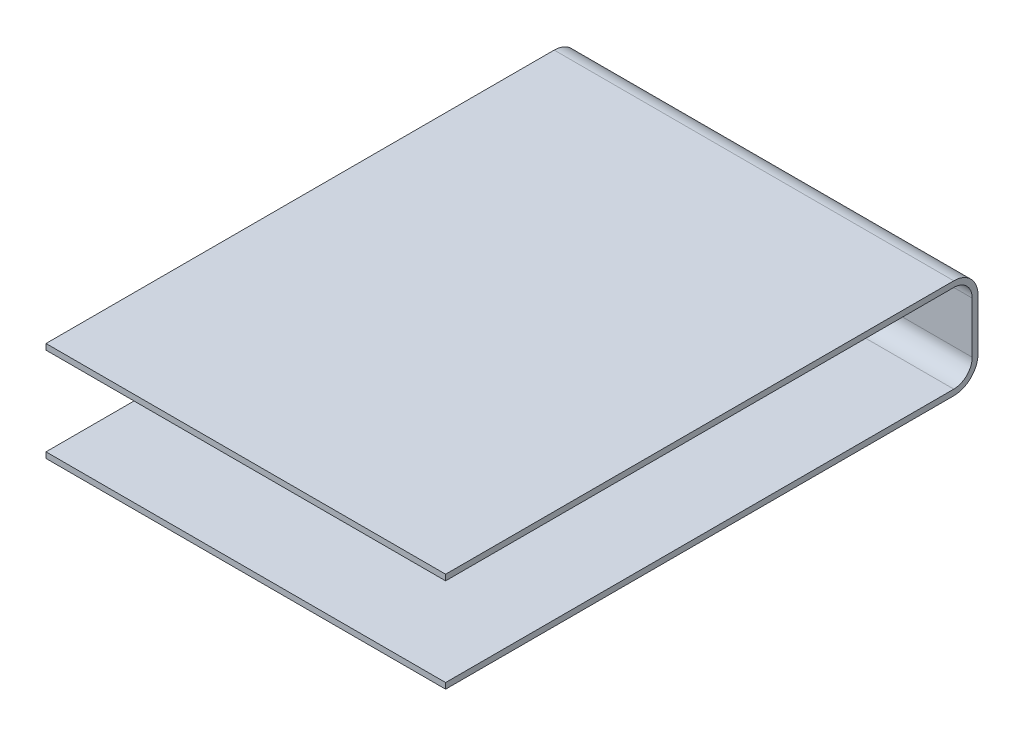
ISO-10303-21;
HEADER;
FILE_DESCRIPTION(('STEP AP214'),'2;1');
FILE_NAME('part.step','',(''),(''),'','','');
FILE_SCHEMA(('AUTOMOTIVE_DESIGN { 1 0 10303 214 1 1 1 1 }'));
ENDSEC;
DATA;
#1=APPLICATION_CONTEXT('core data for automotive mechanical design processes');
#2=APPLICATION_PROTOCOL_DEFINITION('international standard','automotive_design',2000,#1);
#3=PRODUCT_CONTEXT('',#1,'mechanical');
#4=PRODUCT('Part','Part','',(#3));
#5=PRODUCT_RELATED_PRODUCT_CATEGORY('part','',(#4));
#6=PRODUCT_DEFINITION_FORMATION('','',#4);
#7=PRODUCT_DEFINITION_CONTEXT('part definition',#1,'design');
#8=PRODUCT_DEFINITION('design','',#6,#7);
#9=PRODUCT_DEFINITION_SHAPE('','',#8);
#10=(LENGTH_UNIT() NAMED_UNIT(*) SI_UNIT(.MILLI.,.METRE.));
#11=(NAMED_UNIT(*) PLANE_ANGLE_UNIT() SI_UNIT($,.RADIAN.));
#12=(NAMED_UNIT(*) SI_UNIT($,.STERADIAN.) SOLID_ANGLE_UNIT());
#13=UNCERTAINTY_MEASURE_WITH_UNIT(LENGTH_MEASURE(1.E-05),#10,'distance_accuracy_value','');
#14=(GEOMETRIC_REPRESENTATION_CONTEXT(3) GLOBAL_UNCERTAINTY_ASSIGNED_CONTEXT((#13)) GLOBAL_UNIT_ASSIGNED_CONTEXT((#10,
#11,#12)) REPRESENTATION_CONTEXT('',''));
#15=CARTESIAN_POINT('',(0.,0.,0.));
#16=DIRECTION('',(0.,0.,1.));
#17=DIRECTION('',(1.,0.,0.));
#18=AXIS2_PLACEMENT_3D('',#15,#16,#17);
#19=CARTESIAN_POINT('',(-7590.,350.,0.));
#20=DIRECTION('',(1.,0.,0.));
#21=DIRECTION('',(0.,0.,-1.));
#22=AXIS2_PLACEMENT_3D('',#19,#20,#21);
#23=CYLINDRICAL_SURFACE('',#22,350.);
#24=CARTESIAN_POINT('',(0.,350.,0.));
#25=DIRECTION('',(-1.,0.,0.));
#26=DIRECTION('',(0.,0.,-1.));
#27=AXIS2_PLACEMENT_3D('',#24,#25,#26);
#28=CIRCLE('',#27,350.);
#29=CARTESIAN_POINT('',(0.,350.,-350.));
#30=VERTEX_POINT('',#29);
#31=CARTESIAN_POINT('',(0.,0.,0.));
#32=VERTEX_POINT('',#31);
#33=EDGE_CURVE('E157',#30,#32,#28,.T.);
#34=ORIENTED_EDGE('',*,*,#33,.F.);
#35=DIRECTION('',(1.,0.,0.));
#36=VECTOR('',#35,1.);
#37=CARTESIAN_POINT('',(-7590.,350.,-350.));
#38=LINE('',#37,#36);
#39=CARTESIAN_POINT('',(-7590.,350.,-350.));
#40=VERTEX_POINT('',#39);
#41=EDGE_CURVE('E11',#40,#30,#38,.T.);
#42=ORIENTED_EDGE('',*,*,#41,.F.);
#43=CARTESIAN_POINT('',(-7590.,350.,0.));
#44=DIRECTION('',(-1.,0.,0.));
#45=DIRECTION('',(0.,0.,-1.));
#46=AXIS2_PLACEMENT_3D('',#43,#44,#45);
#47=CIRCLE('',#46,350.);
#48=CARTESIAN_POINT('',(-7590.,0.,0.));
#49=VERTEX_POINT('',#48);
#50=EDGE_CURVE('E189',#40,#49,#47,.T.);
#51=ORIENTED_EDGE('',*,*,#50,.T.);
#52=DIRECTION('',(1.,0.,0.));
#53=VECTOR('',#52,1.);
#54=CARTESIAN_POINT('',(-7590.,0.,0.));
#55=LINE('',#54,#53);
#56=EDGE_CURVE('E39',#49,#32,#55,.T.);
#57=ORIENTED_EDGE('',*,*,#56,.T.);
#58=EDGE_LOOP('',(#34,#42,#51,#57));
#59=FACE_BOUND('',#58,.T.);
#60=ADVANCED_FACE('F36',(#59),#23,.F.);
#61=CARTESIAN_POINT('',(-7590.,1322.,-350.));
#62=DIRECTION('',(0.,0.,1.));
#63=DIRECTION('',(0.,-1.,0.));
#64=AXIS2_PLACEMENT_3D('',#61,#62,#63);
#65=PLANE('',#64);
#66=DIRECTION('',(0.,-1.,0.));
#67=VECTOR('',#66,1.);
#68=CARTESIAN_POINT('',(0.,1322.,-350.));
#69=LINE('',#68,#67);
#70=CARTESIAN_POINT('',(0.,1322.,-350.));
#71=VERTEX_POINT('',#70);
#72=EDGE_CURVE('E187',#71,#30,#69,.T.);
#73=ORIENTED_EDGE('',*,*,#72,.F.);
#74=DIRECTION('',(1.,0.,0.));
#75=VECTOR('',#74,1.);
#76=CARTESIAN_POINT('',(-7590.,1322.,-350.));
#77=LINE('',#76,#75);
#78=CARTESIAN_POINT('',(-7590.,1322.,-350.));
#79=VERTEX_POINT('',#78);
#80=EDGE_CURVE('E45',#79,#71,#77,.T.);
#81=ORIENTED_EDGE('',*,*,#80,.F.);
#82=DIRECTION('',(0.,-1.,0.));
#83=VECTOR('',#82,1.);
#84=CARTESIAN_POINT('',(-7590.,1322.,-350.));
#85=LINE('',#84,#83);
#86=EDGE_CURVE('E147',#79,#40,#85,.T.);
#87=ORIENTED_EDGE('',*,*,#86,.T.);
#88=ORIENTED_EDGE('',*,*,#41,.T.);
#89=EDGE_LOOP('',(#73,#81,#87,#88));
#90=FACE_BOUND('',#89,.T.);
#91=ADVANCED_FACE('F209',(#90),#65,.T.);
#92=CARTESIAN_POINT('',(-7590.,1322.,1.66533453693773E-13));
#93=DIRECTION('',(1.,0.,0.));
#94=DIRECTION('',(0.,0.,-1.));
#95=AXIS2_PLACEMENT_3D('',#92,#93,#94);
#96=CYLINDRICAL_SURFACE('',#95,350.);
#97=CARTESIAN_POINT('',(0.,1322.,1.66533453693773E-13));
#98=DIRECTION('',(-1.,0.,0.));
#99=DIRECTION('',(0.,0.,1.));
#100=AXIS2_PLACEMENT_3D('',#97,#98,#99);
#101=CIRCLE('',#100,350.);
#102=CARTESIAN_POINT('',(0.,1672.,2.09396091663931E-13));
#103=VERTEX_POINT('',#102);
#104=EDGE_CURVE('E134',#103,#71,#101,.T.);
#105=ORIENTED_EDGE('',*,*,#104,.F.);
#106=DIRECTION('',(1.,0.,0.));
#107=VECTOR('',#106,1.);
#108=CARTESIAN_POINT('',(-7590.,1672.,2.09396091663931E-13));
#109=LINE('',#108,#107);
#110=CARTESIAN_POINT('',(-7590.,1672.,2.09396091663931E-13));
#111=VERTEX_POINT('',#110);
#112=EDGE_CURVE('E129',#111,#103,#109,.T.);
#113=ORIENTED_EDGE('',*,*,#112,.F.);
#114=CARTESIAN_POINT('',(-7590.,1322.,1.66533453693773E-13));
#115=DIRECTION('',(-1.,0.,0.));
#116=DIRECTION('',(0.,0.,1.));
#117=AXIS2_PLACEMENT_3D('',#114,#115,#116);
#118=CIRCLE('',#117,350.);
#119=EDGE_CURVE('E132',#111,#79,#118,.T.);
#120=ORIENTED_EDGE('',*,*,#119,.T.);
#121=ORIENTED_EDGE('',*,*,#80,.T.);
#122=EDGE_LOOP('',(#105,#113,#120,#121));
#123=FACE_BOUND('',#122,.T.);
#124=ADVANCED_FACE('F131',(#123),#96,.F.);
#125=CARTESIAN_POINT('',(-7590.,1672.,2.09396091663931E-13));
#126=DIRECTION('',(0.,-1.,0.));
#127=DIRECTION('',(0.,0.,-1.));
#128=AXIS2_PLACEMENT_3D('',#125,#126,#127);
#129=PLANE('',#128);
#130=DIRECTION('',(0.,0.,-1.));
#131=VECTOR('',#130,1.);
#132=CARTESIAN_POINT('',(0.,1672.,2.09396091663931E-13));
#133=LINE('',#132,#131);
#134=CARTESIAN_POINT('',(0.,1672.,9652.));
#135=VERTEX_POINT('',#134);
#136=EDGE_CURVE('E184',#135,#103,#133,.T.);
#137=ORIENTED_EDGE('',*,*,#136,.F.);
#138=DIRECTION('',(1.,0.,0.));
#139=VECTOR('',#138,1.);
#140=CARTESIAN_POINT('',(-7590.,1672.,9652.));
#141=LINE('',#140,#139);
#142=CARTESIAN_POINT('',(-7590.,1672.,9652.));
#143=VERTEX_POINT('',#142);
#144=EDGE_CURVE('E139',#143,#135,#141,.T.);
#145=ORIENTED_EDGE('',*,*,#144,.F.);
#146=DIRECTION('',(0.,0.,-1.));
#147=VECTOR('',#146,1.);
#148=CARTESIAN_POINT('',(-7590.,1672.,2.09396091663931E-13));
#149=LINE('',#148,#147);
#150=EDGE_CURVE('E145',#143,#111,#149,.T.);
#151=ORIENTED_EDGE('',*,*,#150,.T.);
#152=ORIENTED_EDGE('',*,*,#112,.T.);
#153=EDGE_LOOP('',(#137,#145,#151,#152));
#154=FACE_BOUND('',#153,.T.);
#155=ADVANCED_FACE('F149',(#154),#129,.T.);
#156=CARTESIAN_POINT('',(-7590.,1672.,9652.));
#157=DIRECTION('',(0.,0.,1.));
#158=DIRECTION('',(1.,0.,0.));
#159=AXIS2_PLACEMENT_3D('',#156,#157,#158);
#160=PLANE('',#159);
#161=DIRECTION('',(0.,-1.,0.));
#162=VECTOR('',#161,1.);
#163=CARTESIAN_POINT('',(0.,1672.,9652.));
#164=LINE('',#163,#162);
#165=CARTESIAN_POINT('',(0.,1782.,9652.));
#166=VERTEX_POINT('',#165);
#167=EDGE_CURVE('E181',#166,#135,#164,.T.);
#168=ORIENTED_EDGE('',*,*,#167,.F.);
#169=DIRECTION('',(1.,0.,0.));
#170=VECTOR('',#169,1.);
#171=CARTESIAN_POINT('',(-7590.,1782.,9652.));
#172=LINE('',#171,#170);
#173=CARTESIAN_POINT('',(-7590.,1782.,9652.));
#174=VERTEX_POINT('',#173);
#175=EDGE_CURVE('E193',#174,#166,#172,.T.);
#176=ORIENTED_EDGE('',*,*,#175,.F.);
#177=DIRECTION('',(0.,-1.,0.));
#178=VECTOR('',#177,1.);
#179=CARTESIAN_POINT('',(-7590.,1672.,9652.));
#180=LINE('',#179,#178);
#181=EDGE_CURVE('E150',#174,#143,#180,.T.);
#182=ORIENTED_EDGE('',*,*,#181,.T.);
#183=ORIENTED_EDGE('',*,*,#144,.T.);
#184=EDGE_LOOP('',(#168,#176,#182,#183));
#185=FACE_BOUND('',#184,.T.);
#186=ADVANCED_FACE('F222',(#185),#160,.T.);
#187=CARTESIAN_POINT('',(-7590.,1782.,9652.));
#188=DIRECTION('',(0.,1.,0.));
#189=DIRECTION('',(0.,0.,1.));
#190=AXIS2_PLACEMENT_3D('',#187,#188,#189);
#191=PLANE('',#190);
#192=DIRECTION('',(0.,0.,1.));
#193=VECTOR('',#192,1.);
#194=CARTESIAN_POINT('',(0.,1782.,9652.));
#195=LINE('',#194,#193);
#196=CARTESIAN_POINT('',(0.,1782.,0.));
#197=VERTEX_POINT('',#196);
#198=EDGE_CURVE('E178',#197,#166,#195,.T.);
#199=ORIENTED_EDGE('',*,*,#198,.F.);
#200=DIRECTION('',(1.,0.,0.));
#201=VECTOR('',#200,1.);
#202=CARTESIAN_POINT('',(-7590.,1782.,0.));
#203=LINE('',#202,#201);
#204=CARTESIAN_POINT('',(-7590.,1782.,0.));
#205=VERTEX_POINT('',#204);
#206=EDGE_CURVE('E195',#205,#197,#203,.T.);
#207=ORIENTED_EDGE('',*,*,#206,.F.);
#208=DIRECTION('',(0.,0.,1.));
#209=VECTOR('',#208,1.);
#210=CARTESIAN_POINT('',(-7590.,1782.,9652.));
#211=LINE('',#210,#209);
#212=EDGE_CURVE('E152',#205,#174,#211,.T.);
#213=ORIENTED_EDGE('',*,*,#212,.T.);
#214=ORIENTED_EDGE('',*,*,#175,.T.);
#215=EDGE_LOOP('',(#199,#207,#213,#214));
#216=FACE_BOUND('',#215,.T.);
#217=ADVANCED_FACE('F225',(#216),#191,.T.);
#218=CARTESIAN_POINT('',(-7590.,1322.,0.));
#219=DIRECTION('',(1.,0.,0.));
#220=DIRECTION('',(0.,0.,-1.));
#221=AXIS2_PLACEMENT_3D('',#218,#219,#220);
#222=CYLINDRICAL_SURFACE('',#221,459.999999999999);
#223=CARTESIAN_POINT('',(0.,1322.,0.));
#224=DIRECTION('',(1.,0.,0.));
#225=DIRECTION('',(0.,0.,1.));
#226=AXIS2_PLACEMENT_3D('',#223,#224,#225);
#227=CIRCLE('',#226,459.999999999999);
#228=CARTESIAN_POINT('',(0.,1322.,-459.999999999999));
#229=VERTEX_POINT('',#228);
#230=EDGE_CURVE('E175',#229,#197,#227,.T.);
#231=ORIENTED_EDGE('',*,*,#230,.F.);
#232=DIRECTION('',(1.,0.,0.));
#233=VECTOR('',#232,1.);
#234=CARTESIAN_POINT('',(-7590.,1322.,-459.999999999999));
#235=LINE('',#234,#233);
#236=CARTESIAN_POINT('',(-7590.,1322.,-459.999999999999));
#237=VERTEX_POINT('',#236);
#238=EDGE_CURVE('E197',#237,#229,#235,.T.);
#239=ORIENTED_EDGE('',*,*,#238,.F.);
#240=CARTESIAN_POINT('',(-7590.,1322.,0.));
#241=DIRECTION('',(1.,0.,0.));
#242=DIRECTION('',(0.,0.,1.));
#243=AXIS2_PLACEMENT_3D('',#240,#241,#242);
#244=CIRCLE('',#243,459.999999999999);
#245=EDGE_CURVE('E351',#237,#205,#244,.T.);
#246=ORIENTED_EDGE('',*,*,#245,.T.);
#247=ORIENTED_EDGE('',*,*,#206,.T.);
#248=EDGE_LOOP('',(#231,#239,#246,#247));
#249=FACE_BOUND('',#248,.T.);
#250=ADVANCED_FACE('F229',(#249),#222,.T.);
#251=CARTESIAN_POINT('',(-7590.,1322.,-459.999999999999));
#252=DIRECTION('',(0.,0.,-1.));
#253=DIRECTION('',(0.,1.,0.));
#254=AXIS2_PLACEMENT_3D('',#251,#252,#253);
#255=PLANE('',#254);
#256=DIRECTION('',(0.,1.,0.));
#257=VECTOR('',#256,1.);
#258=CARTESIAN_POINT('',(0.,1322.,-459.999999999999));
#259=LINE('',#258,#257);
#260=CARTESIAN_POINT('',(0.,349.999999999998,-459.999999999999));
#261=VERTEX_POINT('',#260);
#262=EDGE_CURVE('E172',#261,#229,#259,.T.);
#263=ORIENTED_EDGE('',*,*,#262,.F.);
#264=DIRECTION('',(1.,0.,0.));
#265=VECTOR('',#264,1.);
#266=CARTESIAN_POINT('',(-7590.,349.999999999998,-459.999999999999));
#267=LINE('',#266,#265);
#268=CARTESIAN_POINT('',(-7590.,349.999999999998,-459.999999999999));
#269=VERTEX_POINT('',#268);
#270=EDGE_CURVE('E199',#269,#261,#267,.T.);
#271=ORIENTED_EDGE('',*,*,#270,.F.);
#272=DIRECTION('',(0.,1.,0.));
#273=VECTOR('',#272,1.);
#274=CARTESIAN_POINT('',(-7590.,1322.,-459.999999999999));
#275=LINE('',#274,#273);
#276=EDGE_CURVE('E355',#269,#237,#275,.T.);
#277=ORIENTED_EDGE('',*,*,#276,.T.);
#278=ORIENTED_EDGE('',*,*,#238,.T.);
#279=EDGE_LOOP('',(#263,#271,#277,#278));
#280=FACE_BOUND('',#279,.T.);
#281=ADVANCED_FACE('F233',(#280),#255,.T.);
#282=CARTESIAN_POINT('',(-7590.,349.999999999998,0.));
#283=DIRECTION('',(1.,0.,0.));
#284=DIRECTION('',(0.,0.,-1.));
#285=AXIS2_PLACEMENT_3D('',#282,#283,#284);
#286=CYLINDRICAL_SURFACE('',#285,459.999999999999);
#287=CARTESIAN_POINT('',(0.,349.999999999998,0.));
#288=DIRECTION('',(1.,0.,0.));
#289=DIRECTION('',(0.,0.,-1.));
#290=AXIS2_PLACEMENT_3D('',#287,#288,#289);
#291=CIRCLE('',#290,459.999999999999);
#292=CARTESIAN_POINT('',(0.,-110.000000000001,0.));
#293=VERTEX_POINT('',#292);
#294=EDGE_CURVE('E169',#293,#261,#291,.T.);
#295=ORIENTED_EDGE('',*,*,#294,.F.);
#296=DIRECTION('',(1.,0.,0.));
#297=VECTOR('',#296,1.);
#298=CARTESIAN_POINT('',(-7590.,-110.000000000001,0.));
#299=LINE('',#298,#297);
#300=CARTESIAN_POINT('',(-7590.,-110.000000000001,0.));
#301=VERTEX_POINT('',#300);
#302=EDGE_CURVE('E201',#301,#293,#299,.T.);
#303=ORIENTED_EDGE('',*,*,#302,.F.);
#304=CARTESIAN_POINT('',(-7590.,349.999999999998,0.));
#305=DIRECTION('',(1.,0.,0.));
#306=DIRECTION('',(0.,0.,-1.));
#307=AXIS2_PLACEMENT_3D('',#304,#305,#306);
#308=CIRCLE('',#307,459.999999999999);
#309=EDGE_CURVE('E344',#301,#269,#308,.T.);
#310=ORIENTED_EDGE('',*,*,#309,.T.);
#311=ORIENTED_EDGE('',*,*,#270,.T.);
#312=EDGE_LOOP('',(#295,#303,#310,#311));
#313=FACE_BOUND('',#312,.T.);
#314=ADVANCED_FACE('F237',(#313),#286,.T.);
#315=CARTESIAN_POINT('',(-7590.,-110.000000000001,9652.));
#316=DIRECTION('',(0.,-1.,0.));
#317=DIRECTION('',(0.,0.,-1.));
#318=AXIS2_PLACEMENT_3D('',#315,#316,#317);
#319=PLANE('',#318);
#320=DIRECTION('',(0.,0.,-1.));
#321=VECTOR('',#320,1.);
#322=CARTESIAN_POINT('',(0.,-110.000000000001,9652.));
#323=LINE('',#322,#321);
#324=CARTESIAN_POINT('',(0.,-110.000000000001,9652.));
#325=VERTEX_POINT('',#324);
#326=EDGE_CURVE('E166',#325,#293,#323,.T.);
#327=ORIENTED_EDGE('',*,*,#326,.F.);
#328=DIRECTION('',(1.,0.,0.));
#329=VECTOR('',#328,1.);
#330=CARTESIAN_POINT('',(-7590.,-110.000000000001,9652.));
#331=LINE('',#330,#329);
#332=CARTESIAN_POINT('',(-7590.,-110.000000000001,9652.));
#333=VERTEX_POINT('',#332);
#334=EDGE_CURVE('E203',#333,#325,#331,.T.);
#335=ORIENTED_EDGE('',*,*,#334,.F.);
#336=DIRECTION('',(0.,0.,-1.));
#337=VECTOR('',#336,1.);
#338=CARTESIAN_POINT('',(-7590.,-110.000000000001,9652.));
#339=LINE('',#338,#337);
#340=EDGE_CURVE('E340',#333,#301,#339,.T.);
#341=ORIENTED_EDGE('',*,*,#340,.T.);
#342=ORIENTED_EDGE('',*,*,#302,.T.);
#343=EDGE_LOOP('',(#327,#335,#341,#342));
#344=FACE_BOUND('',#343,.T.);
#345=ADVANCED_FACE('F241',(#344),#319,.T.);
#346=CARTESIAN_POINT('',(-7590.,-1.18202909053703E-12,9652.));
#347=DIRECTION('',(0.,0.,1.));
#348=DIRECTION('',(1.,0.,0.));
#349=AXIS2_PLACEMENT_3D('',#346,#347,#348);
#350=PLANE('',#349);
#351=DIRECTION('',(0.,-1.,0.));
#352=VECTOR('',#351,1.);
#353=CARTESIAN_POINT('',(0.,-1.18202909053703E-12,9652.));
#354=LINE('',#353,#352);
#355=CARTESIAN_POINT('',(0.,-1.18202909053703E-12,9652.));
#356=VERTEX_POINT('',#355);
#357=EDGE_CURVE('E163',#356,#325,#354,.T.);
#358=ORIENTED_EDGE('',*,*,#357,.F.);
#359=DIRECTION('',(1.,0.,0.));
#360=VECTOR('',#359,1.);
#361=CARTESIAN_POINT('',(-7590.,-1.18202909053703E-12,9652.));
#362=LINE('',#361,#360);
#363=CARTESIAN_POINT('',(-7590.,-1.18202909053703E-12,9652.));
#364=VERTEX_POINT('',#363);
#365=EDGE_CURVE('E204',#364,#356,#362,.T.);
#366=ORIENTED_EDGE('',*,*,#365,.F.);
#367=DIRECTION('',(0.,-1.,0.));
#368=VECTOR('',#367,1.);
#369=CARTESIAN_POINT('',(-7590.,-1.18202909053703E-12,9652.));
#370=LINE('',#369,#368);
#371=EDGE_CURVE('E361',#364,#333,#370,.T.);
#372=ORIENTED_EDGE('',*,*,#371,.T.);
#373=ORIENTED_EDGE('',*,*,#334,.T.);
#374=EDGE_LOOP('',(#358,#366,#372,#373));
#375=FACE_BOUND('',#374,.T.);
#376=ADVANCED_FACE('F245',(#375),#350,.T.);
#377=CARTESIAN_POINT('',(-7590.,0.,0.));
#378=DIRECTION('',(0.,1.,0.));
#379=DIRECTION('',(0.,0.,1.));
#380=AXIS2_PLACEMENT_3D('',#377,#378,#379);
#381=PLANE('',#380);
#382=DIRECTION('',(0.,0.,1.));
#383=VECTOR('',#382,1.);
#384=CARTESIAN_POINT('',(0.,0.,0.));
#385=LINE('',#384,#383);
#386=EDGE_CURVE('E160',#32,#356,#385,.T.);
#387=ORIENTED_EDGE('',*,*,#386,.F.);
#388=ORIENTED_EDGE('',*,*,#56,.F.);
#389=DIRECTION('',(0.,0.,1.));
#390=VECTOR('',#389,1.);
#391=CARTESIAN_POINT('',(-7590.,0.,0.));
#392=LINE('',#391,#390);
#393=EDGE_CURVE('E363',#49,#364,#392,.T.);
#394=ORIENTED_EDGE('',*,*,#393,.T.);
#395=ORIENTED_EDGE('',*,*,#365,.T.);
#396=EDGE_LOOP('',(#387,#388,#394,#395));
#397=FACE_BOUND('',#396,.T.);
#398=ADVANCED_FACE('F206',(#397),#381,.T.);
#399=CARTESIAN_POINT('',(-7590.,350.,0.));
#400=DIRECTION('',(1.,0.,0.));
#401=DIRECTION('',(0.,0.,-1.));
#402=AXIS2_PLACEMENT_3D('',#399,#400,#401);
#403=PLANE('',#402);
#404=ORIENTED_EDGE('',*,*,#50,.F.);
#405=ORIENTED_EDGE('',*,*,#86,.F.);
#406=ORIENTED_EDGE('',*,*,#119,.F.);
#407=ORIENTED_EDGE('',*,*,#150,.F.);
#408=ORIENTED_EDGE('',*,*,#181,.F.);
#409=ORIENTED_EDGE('',*,*,#212,.F.);
#410=ORIENTED_EDGE('',*,*,#245,.F.);
#411=ORIENTED_EDGE('',*,*,#276,.F.);
#412=ORIENTED_EDGE('',*,*,#309,.F.);
#413=ORIENTED_EDGE('',*,*,#340,.F.);
#414=ORIENTED_EDGE('',*,*,#371,.F.);
#415=ORIENTED_EDGE('',*,*,#393,.F.);
#416=EDGE_LOOP('',(#404,#405,#406,#407,#408,#409,#410,#411,#412,#413,#414,#415));
#417=FACE_BOUND('',#416,.T.);
#418=ADVANCED_FACE('F143',(#417),#403,.F.);
#419=CARTESIAN_POINT('',(0.,350.,0.));
#420=DIRECTION('',(1.,0.,0.));
#421=DIRECTION('',(0.,0.,-1.));
#422=AXIS2_PLACEMENT_3D('',#419,#420,#421);
#423=PLANE('',#422);
#424=ORIENTED_EDGE('',*,*,#33,.T.);
#425=ORIENTED_EDGE('',*,*,#386,.T.);
#426=ORIENTED_EDGE('',*,*,#357,.T.);
#427=ORIENTED_EDGE('',*,*,#326,.T.);
#428=ORIENTED_EDGE('',*,*,#294,.T.);
#429=ORIENTED_EDGE('',*,*,#262,.T.);
#430=ORIENTED_EDGE('',*,*,#230,.T.);
#431=ORIENTED_EDGE('',*,*,#198,.T.);
#432=ORIENTED_EDGE('',*,*,#167,.T.);
#433=ORIENTED_EDGE('',*,*,#136,.T.);
#434=ORIENTED_EDGE('',*,*,#104,.T.);
#435=ORIENTED_EDGE('',*,*,#72,.T.);
#436=EDGE_LOOP('',(#424,#425,#426,#427,#428,#429,#430,#431,#432,#433,#434,#435));
#437=FACE_BOUND('',#436,.T.);
#438=ADVANCED_FACE('F208',(#437),#423,.T.);
#439=CLOSED_SHELL('',(#60,#91,#124,#155,#186,#217,#250,#281,#314,#345,#376,#398,#418,#438));
#440=MANIFOLD_SOLID_BREP('B2',#439);
#441=ADVANCED_BREP_SHAPE_REPRESENTATION('',(#18,#440),#14);
#442=SHAPE_DEFINITION_REPRESENTATION(#9,#441);
ENDSEC;
END-ISO-10303-21;
